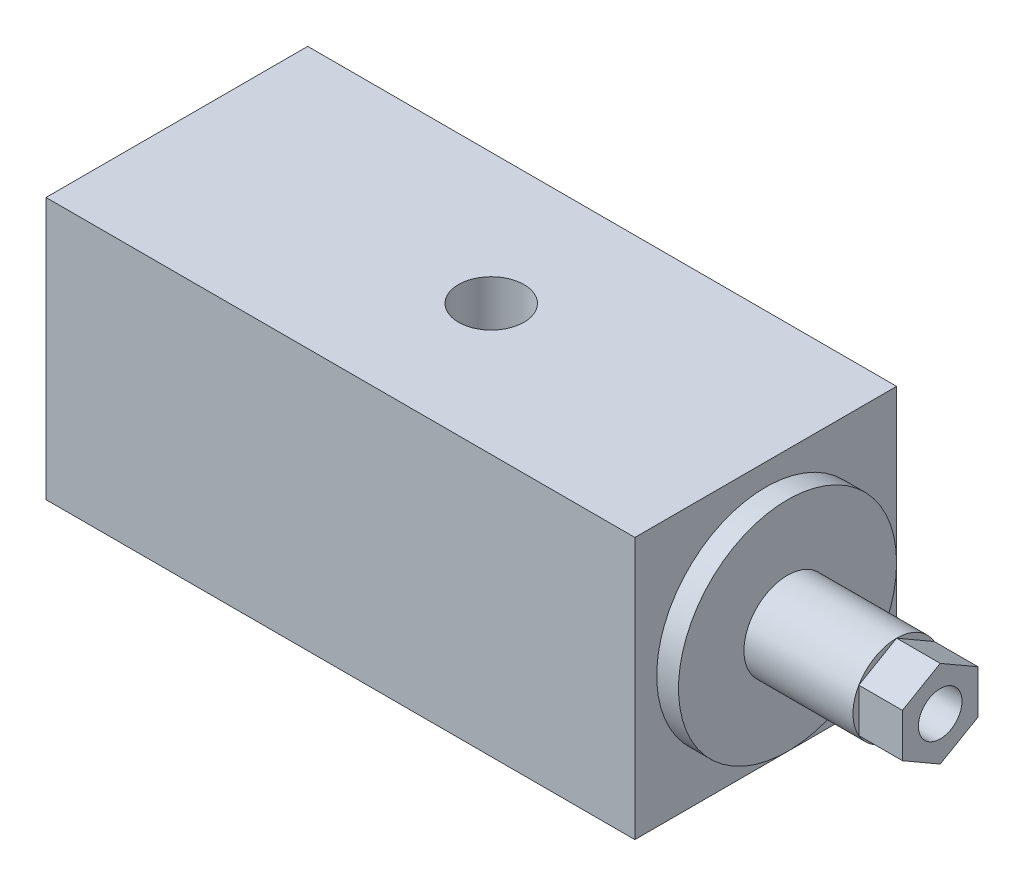
ISO-10303-21;
HEADER;
FILE_DESCRIPTION(('STEP AP214'),'2;1');
FILE_NAME('part.step','',(''),(''),'','','');
FILE_SCHEMA(('AUTOMOTIVE_DESIGN { 1 0 10303 214 1 1 1 1 }'));
ENDSEC;
DATA;
#1=APPLICATION_CONTEXT('core data for automotive mechanical design processes');
#2=APPLICATION_PROTOCOL_DEFINITION('international standard','automotive_design',2000,#1);
#3=PRODUCT_CONTEXT('',#1,'mechanical');
#4=PRODUCT('Part','Part','',(#3));
#5=PRODUCT_RELATED_PRODUCT_CATEGORY('part','',(#4));
#6=PRODUCT_DEFINITION_FORMATION('','',#4);
#7=PRODUCT_DEFINITION_CONTEXT('part definition',#1,'design');
#8=PRODUCT_DEFINITION('design','',#6,#7);
#9=PRODUCT_DEFINITION_SHAPE('','',#8);
#10=(LENGTH_UNIT() NAMED_UNIT(*) SI_UNIT(.MILLI.,.METRE.));
#11=(NAMED_UNIT(*) PLANE_ANGLE_UNIT() SI_UNIT($,.RADIAN.));
#12=(NAMED_UNIT(*) SI_UNIT($,.STERADIAN.) SOLID_ANGLE_UNIT());
#13=UNCERTAINTY_MEASURE_WITH_UNIT(LENGTH_MEASURE(1.E-05),#10,'distance_accuracy_value','');
#14=(GEOMETRIC_REPRESENTATION_CONTEXT(3) GLOBAL_UNCERTAINTY_ASSIGNED_CONTEXT((#13)) GLOBAL_UNIT_ASSIGNED_CONTEXT((#10,
#11,#12)) REPRESENTATION_CONTEXT('',''));
#15=CARTESIAN_POINT('',(0.,0.,0.));
#16=DIRECTION('',(0.,0.,1.));
#17=DIRECTION('',(1.,0.,0.));
#18=AXIS2_PLACEMENT_3D('',#15,#16,#17);
#19=CARTESIAN_POINT('',(1.927606,-9.525,0.));
#20=DIRECTION('',(0.,1.,0.));
#21=DIRECTION('',(0.,0.,1.));
#22=AXIS2_PLACEMENT_3D('',#19,#20,#21);
#23=CYLINDRICAL_SURFACE('',#22,2.38125);
#24=CARTESIAN_POINT('',(1.927606,9.525,0.));
#25=DIRECTION('',(0.,1.,0.));
#26=DIRECTION('',(0.,0.,1.));
#27=AXIS2_PLACEMENT_3D('',#24,#25,#26);
#28=CIRCLE('',#27,2.38125);
#29=CARTESIAN_POINT('',(1.927606,9.525,2.38125));
#30=VERTEX_POINT('',#29);
#31=EDGE_CURVE('E228',#30,#30,#28,.T.);
#32=ORIENTED_EDGE('',*,*,#31,.T.);
#33=EDGE_LOOP('',(#32));
#34=FACE_BOUND('',#33,.T.);
#35=CARTESIAN_POINT('',(1.92760599999999,0.,0.));
#36=DIRECTION('',(-0.707106781186547,0.707106781186548,0.));
#37=DIRECTION('',(0.707106781186547,0.707106781186548,0.));
#38=AXIS2_PLACEMENT_3D('',#35,#36,#37);
#39=ELLIPSE('',#38,3.36759604540093,2.38125);
#40=CARTESIAN_POINT('',(1.92760599999999,0.,-2.38125));
#41=VERTEX_POINT('',#40);
#42=CARTESIAN_POINT('',(1.92760599999999,0.,2.38125));
#43=VERTEX_POINT('',#42);
#44=EDGE_CURVE('E46',#41,#43,#39,.F.);
#45=ORIENTED_EDGE('',*,*,#44,.T.);
#46=CARTESIAN_POINT('',(1.92760599999999,0.,0.));
#47=DIRECTION('',(0.707106781186547,0.707106781186548,0.));
#48=DIRECTION('',(-0.707106781186547,0.707106781186548,0.));
#49=AXIS2_PLACEMENT_3D('',#46,#47,#48);
#50=ELLIPSE('',#49,3.36759604540093,2.38125);
#51=EDGE_CURVE('E11',#43,#41,#50,.F.);
#52=ORIENTED_EDGE('',*,*,#51,.T.);
#53=EDGE_LOOP('',(#45,#52));
#54=FACE_BOUND('',#53,.T.);
#55=ADVANCED_FACE('F33',(#34,#54),#23,.F.);
#56=CARTESIAN_POINT('',(34.6075,0.,0.));
#57=DIRECTION('',(-1.,0.,0.));
#58=DIRECTION('',(0.,0.,1.));
#59=AXIS2_PLACEMENT_3D('',#56,#57,#58);
#60=CYLINDRICAL_SURFACE('',#59,3.175);
#61=CARTESIAN_POINT('',(23.495,0.,0.));
#62=DIRECTION('',(1.,0.,0.));
#63=DIRECTION('',(0.,0.,-1.));
#64=AXIS2_PLACEMENT_3D('',#61,#62,#63);
#65=CIRCLE('',#64,3.175);
#66=CARTESIAN_POINT('',(23.495,0.,-3.175));
#67=VERTEX_POINT('',#66);
#68=EDGE_CURVE('E138',#67,#67,#65,.T.);
#69=ORIENTED_EDGE('',*,*,#68,.T.);
#70=EDGE_LOOP('',(#69));
#71=FACE_BOUND('',#70,.T.);
#72=CARTESIAN_POINT('',(31.4325,0.,0.));
#73=DIRECTION('',(1.,0.,0.));
#74=DIRECTION('',(0.,0.,-1.));
#75=AXIS2_PLACEMENT_3D('',#72,#73,#74);
#76=CIRCLE('',#75,3.175);
#77=CARTESIAN_POINT('',(31.4325,-3.175,0.));
#78=VERTEX_POINT('',#77);
#79=CARTESIAN_POINT('',(31.4325,-1.5875,-2.74963065701559));
#80=VERTEX_POINT('',#79);
#81=EDGE_CURVE('E125',#78,#80,#76,.T.);
#82=ORIENTED_EDGE('',*,*,#81,.F.);
#83=CARTESIAN_POINT('',(31.4325,-1.5875,2.74963065701559));
#84=VERTEX_POINT('',#83);
#85=EDGE_CURVE('E558',#84,#78,#76,.T.);
#86=ORIENTED_EDGE('',*,*,#85,.F.);
#87=CARTESIAN_POINT('',(31.4325,1.5875,2.74963065701559));
#88=VERTEX_POINT('',#87);
#89=EDGE_CURVE('E568',#88,#84,#76,.T.);
#90=ORIENTED_EDGE('',*,*,#89,.F.);
#91=CARTESIAN_POINT('',(31.4325,3.175,0.));
#92=VERTEX_POINT('',#91);
#93=EDGE_CURVE('E563',#92,#88,#76,.T.);
#94=ORIENTED_EDGE('',*,*,#93,.F.);
#95=CARTESIAN_POINT('',(31.4325,1.5875,-2.74963065701559));
#96=VERTEX_POINT('',#95);
#97=EDGE_CURVE('E137',#96,#92,#76,.T.);
#98=ORIENTED_EDGE('',*,*,#97,.F.);
#99=EDGE_CURVE('E135',#80,#96,#76,.T.);
#100=ORIENTED_EDGE('',*,*,#99,.F.);
#101=EDGE_LOOP('',(#82,#86,#90,#94,#98,#100));
#102=FACE_BOUND('',#101,.T.);
#103=ADVANCED_FACE('F252',(#71,#102),#60,.T.);
#104=CARTESIAN_POINT('',(-17.78,9.525,-9.525));
#105=DIRECTION('',(0.,0.,-1.));
#106=DIRECTION('',(0.,1.,0.));
#107=AXIS2_PLACEMENT_3D('',#104,#105,#106);
#108=PLANE('',#107);
#109=DIRECTION('',(1.,0.,0.));
#110=VECTOR('',#109,1.);
#111=CARTESIAN_POINT('',(-17.78,9.525,-9.525));
#112=LINE('',#111,#110);
#113=CARTESIAN_POINT('',(-20.955,9.525,-9.525));
#114=VERTEX_POINT('',#113);
#115=CARTESIAN_POINT('',(21.9075,9.525,-9.525));
#116=VERTEX_POINT('',#115);
#117=EDGE_CURVE('E139',#114,#116,#112,.T.);
#118=ORIENTED_EDGE('',*,*,#117,.T.);
#119=DIRECTION('',(0.,1.,0.));
#120=VECTOR('',#119,1.);
#121=CARTESIAN_POINT('',(21.9075,-9.525,-9.525));
#122=LINE('',#121,#120);
#123=CARTESIAN_POINT('',(21.9075,-9.525,-9.525));
#124=VERTEX_POINT('',#123);
#125=EDGE_CURVE('E157',#124,#116,#122,.T.);
#126=ORIENTED_EDGE('',*,*,#125,.F.);
#127=DIRECTION('',(1.,0.,0.));
#128=VECTOR('',#127,1.);
#129=CARTESIAN_POINT('',(-17.78,-9.525,-9.525));
#130=LINE('',#129,#128);
#131=CARTESIAN_POINT('',(-20.955,-9.525,-9.525));
#132=VERTEX_POINT('',#131);
#133=EDGE_CURVE('E146',#132,#124,#130,.T.);
#134=ORIENTED_EDGE('',*,*,#133,.F.);
#135=DIRECTION('',(0.,-1.,0.));
#136=VECTOR('',#135,1.);
#137=CARTESIAN_POINT('',(-20.955,9.525,-9.525));
#138=LINE('',#137,#136);
#139=EDGE_CURVE('E169',#114,#132,#138,.T.);
#140=ORIENTED_EDGE('',*,*,#139,.F.);
#141=EDGE_LOOP('',(#118,#126,#134,#140));
#142=FACE_BOUND('',#141,.T.);
#143=ADVANCED_FACE('F35',(#142),#108,.T.);
#144=CARTESIAN_POINT('',(-17.78,-9.525,9.525));
#145=DIRECTION('',(0.,-1.,0.));
#146=DIRECTION('',(0.,0.,-1.));
#147=AXIS2_PLACEMENT_3D('',#144,#145,#146);
#148=PLANE('',#147);
#149=CARTESIAN_POINT('',(1.927606,-9.525,0.));
#150=DIRECTION('',(0.,1.,0.));
#151=DIRECTION('',(0.,0.,1.));
#152=AXIS2_PLACEMENT_3D('',#149,#150,#151);
#153=CIRCLE('',#152,2.38125);
#154=CARTESIAN_POINT('',(1.927606,-9.525,2.38125));
#155=VERTEX_POINT('',#154);
#156=EDGE_CURVE('E211',#155,#155,#153,.T.);
#157=ORIENTED_EDGE('',*,*,#156,.T.);
#158=EDGE_LOOP('',(#157));
#159=FACE_BOUND('',#158,.T.);
#160=ORIENTED_EDGE('',*,*,#133,.T.);
#161=DIRECTION('',(0.,0.,-1.));
#162=VECTOR('',#161,1.);
#163=CARTESIAN_POINT('',(21.9075,-9.525,9.525));
#164=LINE('',#163,#162);
#165=CARTESIAN_POINT('',(21.9075,-9.525,9.525));
#166=VERTEX_POINT('',#165);
#167=EDGE_CURVE('E142',#166,#124,#164,.T.);
#168=ORIENTED_EDGE('',*,*,#167,.F.);
#169=DIRECTION('',(1.,0.,0.));
#170=VECTOR('',#169,1.);
#171=CARTESIAN_POINT('',(-17.78,-9.525,9.525));
#172=LINE('',#171,#170);
#173=CARTESIAN_POINT('',(-20.955,-9.525,9.525));
#174=VERTEX_POINT('',#173);
#175=EDGE_CURVE('E144',#174,#166,#172,.T.);
#176=ORIENTED_EDGE('',*,*,#175,.F.);
#177=DIRECTION('',(0.,0.,1.));
#178=VECTOR('',#177,1.);
#179=CARTESIAN_POINT('',(-20.955,-9.525,9.525));
#180=LINE('',#179,#178);
#181=EDGE_CURVE('E166',#132,#174,#180,.T.);
#182=ORIENTED_EDGE('',*,*,#181,.F.);
#183=EDGE_LOOP('',(#160,#168,#176,#182));
#184=FACE_BOUND('',#183,.T.);
#185=ADVANCED_FACE('F298',(#159,#184),#148,.T.);
#186=CARTESIAN_POINT('',(-17.78,9.525,9.525));
#187=DIRECTION('',(0.,0.,1.));
#188=DIRECTION('',(0.,-1.,0.));
#189=AXIS2_PLACEMENT_3D('',#186,#187,#188);
#190=PLANE('',#189);
#191=ORIENTED_EDGE('',*,*,#175,.T.);
#192=DIRECTION('',(0.,-1.,0.));
#193=VECTOR('',#192,1.);
#194=CARTESIAN_POINT('',(21.9075,-9.525,9.525));
#195=LINE('',#194,#193);
#196=CARTESIAN_POINT('',(21.9075,9.525,9.525));
#197=VERTEX_POINT('',#196);
#198=EDGE_CURVE('E151',#197,#166,#195,.T.);
#199=ORIENTED_EDGE('',*,*,#198,.F.);
#200=DIRECTION('',(1.,0.,0.));
#201=VECTOR('',#200,1.);
#202=CARTESIAN_POINT('',(-17.78,9.525,9.525));
#203=LINE('',#202,#201);
#204=CARTESIAN_POINT('',(-20.955,9.525,9.525));
#205=VERTEX_POINT('',#204);
#206=EDGE_CURVE('E141',#205,#197,#203,.T.);
#207=ORIENTED_EDGE('',*,*,#206,.F.);
#208=DIRECTION('',(0.,1.,0.));
#209=VECTOR('',#208,1.);
#210=CARTESIAN_POINT('',(-20.955,9.525,9.525));
#211=LINE('',#210,#209);
#212=EDGE_CURVE('E163',#174,#205,#211,.T.);
#213=ORIENTED_EDGE('',*,*,#212,.F.);
#214=EDGE_LOOP('',(#191,#199,#207,#213));
#215=FACE_BOUND('',#214,.T.);
#216=ADVANCED_FACE('F301',(#215),#190,.T.);
#217=CARTESIAN_POINT('',(-17.78,9.525,9.525));
#218=DIRECTION('',(0.,1.,0.));
#219=DIRECTION('',(0.,0.,1.));
#220=AXIS2_PLACEMENT_3D('',#217,#218,#219);
#221=PLANE('',#220);
#222=ORIENTED_EDGE('',*,*,#31,.F.);
#223=EDGE_LOOP('',(#222));
#224=FACE_BOUND('',#223,.T.);
#225=ORIENTED_EDGE('',*,*,#206,.T.);
#226=DIRECTION('',(0.,0.,1.));
#227=VECTOR('',#226,1.);
#228=CARTESIAN_POINT('',(21.9075,9.525,9.525));
#229=LINE('',#228,#227);
#230=EDGE_CURVE('E154',#116,#197,#229,.T.);
#231=ORIENTED_EDGE('',*,*,#230,.F.);
#232=ORIENTED_EDGE('',*,*,#117,.F.);
#233=DIRECTION('',(0.,0.,-1.));
#234=VECTOR('',#233,1.);
#235=CARTESIAN_POINT('',(-20.955,9.525,9.525));
#236=LINE('',#235,#234);
#237=EDGE_CURVE('E160',#205,#114,#236,.T.);
#238=ORIENTED_EDGE('',*,*,#237,.F.);
#239=EDGE_LOOP('',(#225,#231,#232,#238));
#240=FACE_BOUND('',#239,.T.);
#241=ADVANCED_FACE('F296',(#224,#240),#221,.T.);
#242=CARTESIAN_POINT('',(21.9075,0.,0.));
#243=DIRECTION('',(-1.,0.,0.));
#244=DIRECTION('',(0.,0.,1.));
#245=AXIS2_PLACEMENT_3D('',#242,#243,#244);
#246=PLANE('',#245);
#247=CARTESIAN_POINT('',(21.9075,0.,0.));
#248=DIRECTION('',(1.,0.,0.));
#249=DIRECTION('',(0.,0.,-1.));
#250=AXIS2_PLACEMENT_3D('',#247,#248,#249);
#251=CIRCLE('',#250,7.9375);
#252=CARTESIAN_POINT('',(21.9075,0.,-7.9375));
#253=VERTEX_POINT('',#252);
#254=EDGE_CURVE('E148',#253,#253,#251,.T.);
#255=ORIENTED_EDGE('',*,*,#254,.F.);
#256=EDGE_LOOP('',(#255));
#257=FACE_BOUND('',#256,.T.);
#258=ORIENTED_EDGE('',*,*,#125,.T.);
#259=ORIENTED_EDGE('',*,*,#230,.T.);
#260=ORIENTED_EDGE('',*,*,#198,.T.);
#261=ORIENTED_EDGE('',*,*,#167,.T.);
#262=EDGE_LOOP('',(#258,#259,#260,#261));
#263=FACE_BOUND('',#262,.T.);
#264=ADVANCED_FACE('F293',(#257,#263),#246,.F.);
#265=CARTESIAN_POINT('',(-20.955,0.,0.));
#266=DIRECTION('',(1.,0.,0.));
#267=DIRECTION('',(0.,0.,-1.));
#268=AXIS2_PLACEMENT_3D('',#265,#266,#267);
#269=PLANE('',#268);
#270=CARTESIAN_POINT('',(-20.955,0.,0.));
#271=DIRECTION('',(1.,0.,0.));
#272=DIRECTION('',(0.,0.,-1.));
#273=AXIS2_PLACEMENT_3D('',#270,#271,#272);
#274=CIRCLE('',#273,2.38125);
#275=CARTESIAN_POINT('',(-20.955,0.,-2.38125));
#276=VERTEX_POINT('',#275);
#277=EDGE_CURVE('E134',#276,#276,#274,.T.);
#278=ORIENTED_EDGE('',*,*,#277,.T.);
#279=EDGE_LOOP('',(#278));
#280=FACE_BOUND('',#279,.T.);
#281=ORIENTED_EDGE('',*,*,#139,.T.);
#282=ORIENTED_EDGE('',*,*,#181,.T.);
#283=ORIENTED_EDGE('',*,*,#212,.T.);
#284=ORIENTED_EDGE('',*,*,#237,.T.);
#285=EDGE_LOOP('',(#281,#282,#283,#284));
#286=FACE_BOUND('',#285,.T.);
#287=ADVANCED_FACE('F239',(#280,#286),#269,.F.);
#288=CARTESIAN_POINT('',(23.495,0.,0.));
#289=DIRECTION('',(-1.,0.,0.));
#290=DIRECTION('',(0.,0.,1.));
#291=AXIS2_PLACEMENT_3D('',#288,#289,#290);
#292=CYLINDRICAL_SURFACE('',#291,7.9375);
#293=CARTESIAN_POINT('',(23.495,0.,0.));
#294=DIRECTION('',(1.,0.,0.));
#295=DIRECTION('',(0.,0.,-1.));
#296=AXIS2_PLACEMENT_3D('',#293,#294,#295);
#297=CIRCLE('',#296,7.9375);
#298=CARTESIAN_POINT('',(23.495,0.,-7.9375));
#299=VERTEX_POINT('',#298);
#300=EDGE_CURVE('E172',#299,#299,#297,.T.);
#301=ORIENTED_EDGE('',*,*,#300,.F.);
#302=EDGE_LOOP('',(#301));
#303=FACE_BOUND('',#302,.T.);
#304=ORIENTED_EDGE('',*,*,#254,.T.);
#305=EDGE_LOOP('',(#304));
#306=FACE_BOUND('',#305,.T.);
#307=ADVANCED_FACE('F286',(#303,#306),#292,.T.);
#308=CARTESIAN_POINT('',(23.495,0.,0.));
#309=DIRECTION('',(1.,0.,0.));
#310=DIRECTION('',(0.,0.,-1.));
#311=AXIS2_PLACEMENT_3D('',#308,#309,#310);
#312=PLANE('',#311);
#313=ORIENTED_EDGE('',*,*,#68,.F.);
#314=EDGE_LOOP('',(#313));
#315=FACE_BOUND('',#314,.T.);
#316=ORIENTED_EDGE('',*,*,#300,.T.);
#317=EDGE_LOOP('',(#316));
#318=FACE_BOUND('',#317,.T.);
#319=ADVANCED_FACE('F283',(#315,#318),#312,.T.);
#320=CARTESIAN_POINT('',(31.4325,0.,0.));
#321=DIRECTION('',(1.,0.,0.));
#322=DIRECTION('',(0.,0.,-1.));
#323=AXIS2_PLACEMENT_3D('',#320,#321,#322);
#324=PLANE('',#323);
#325=ORIENTED_EDGE('',*,*,#97,.T.);
#326=DIRECTION('',(0.,0.5,0.866025403784439));
#327=VECTOR('',#326,1.);
#328=CARTESIAN_POINT('',(31.4325,1.5875,-2.74963065701559));
#329=LINE('',#328,#327);
#330=EDGE_CURVE('E217',#96,#92,#329,.T.);
#331=ORIENTED_EDGE('',*,*,#330,.F.);
#332=EDGE_LOOP('',(#325,#331));
#333=FACE_BOUND('',#332,.T.);
#334=ADVANCED_FACE('F280',(#333),#324,.T.);
#335=ORIENTED_EDGE('',*,*,#93,.T.);
#336=DIRECTION('',(0.,-0.5,0.866025403784439));
#337=VECTOR('',#336,1.);
#338=CARTESIAN_POINT('',(31.4325,3.175,0.));
#339=LINE('',#338,#337);
#340=EDGE_CURVE('E214',#92,#88,#339,.T.);
#341=ORIENTED_EDGE('',*,*,#340,.F.);
#342=EDGE_LOOP('',(#335,#341));
#343=FACE_BOUND('',#342,.T.);
#344=ADVANCED_FACE('F372',(#343),#324,.T.);
#345=ORIENTED_EDGE('',*,*,#89,.T.);
#346=DIRECTION('',(0.,-1.,0.));
#347=VECTOR('',#346,1.);
#348=CARTESIAN_POINT('',(31.4325,1.5875,2.74963065701559));
#349=LINE('',#348,#347);
#350=EDGE_CURVE('E183',#88,#84,#349,.T.);
#351=ORIENTED_EDGE('',*,*,#350,.F.);
#352=EDGE_LOOP('',(#345,#351));
#353=FACE_BOUND('',#352,.T.);
#354=ADVANCED_FACE('F382',(#353),#324,.T.);
#355=ORIENTED_EDGE('',*,*,#85,.T.);
#356=DIRECTION('',(0.,-0.5,-0.866025403784438));
#357=VECTOR('',#356,1.);
#358=CARTESIAN_POINT('',(31.4325,-1.5875,2.74963065701559));
#359=LINE('',#358,#357);
#360=EDGE_CURVE('E195',#84,#78,#359,.T.);
#361=ORIENTED_EDGE('',*,*,#360,.F.);
#362=EDGE_LOOP('',(#355,#361));
#363=FACE_BOUND('',#362,.T.);
#364=ADVANCED_FACE('F391',(#363),#324,.T.);
#365=ORIENTED_EDGE('',*,*,#81,.T.);
#366=DIRECTION('',(0.,0.5,-0.866025403784439));
#367=VECTOR('',#366,1.);
#368=CARTESIAN_POINT('',(31.4325,-3.175,0.));
#369=LINE('',#368,#367);
#370=EDGE_CURVE('E54',#78,#80,#369,.T.);
#371=ORIENTED_EDGE('',*,*,#370,.F.);
#372=EDGE_LOOP('',(#365,#371));
#373=FACE_BOUND('',#372,.T.);
#374=ADVANCED_FACE('F400',(#373),#324,.T.);
#375=ORIENTED_EDGE('',*,*,#99,.T.);
#376=DIRECTION('',(0.,1.,0.));
#377=VECTOR('',#376,1.);
#378=CARTESIAN_POINT('',(31.4325,-1.5875,-2.74963065701559));
#379=LINE('',#378,#377);
#380=EDGE_CURVE('E220',#80,#96,#379,.T.);
#381=ORIENTED_EDGE('',*,*,#380,.F.);
#382=EDGE_LOOP('',(#375,#381));
#383=FACE_BOUND('',#382,.T.);
#384=ADVANCED_FACE('F374',(#383),#324,.T.);
#385=CARTESIAN_POINT('',(31.4325,-1.5875,2.74963065701559));
#386=DIRECTION('',(0.,-0.866025403784438,0.5));
#387=DIRECTION('',(0.,-0.5,-0.866025403784439));
#388=AXIS2_PLACEMENT_3D('',#385,#386,#387);
#389=PLANE('',#388);
#390=DIRECTION('',(0.,-0.5,-0.866025403784438));
#391=VECTOR('',#390,1.);
#392=CARTESIAN_POINT('',(34.6075,-1.5875,2.74963065701559));
#393=LINE('',#392,#391);
#394=CARTESIAN_POINT('',(34.6075,-1.5875,2.74963065701559));
#395=VERTEX_POINT('',#394);
#396=CARTESIAN_POINT('',(34.6075,-3.175,0.));
#397=VERTEX_POINT('',#396);
#398=EDGE_CURVE('E208',#395,#397,#393,.T.);
#399=ORIENTED_EDGE('',*,*,#398,.F.);
#400=DIRECTION('',(1.,0.,0.));
#401=VECTOR('',#400,1.);
#402=CARTESIAN_POINT('',(31.4325,-1.5875,2.74963065701559));
#403=LINE('',#402,#401);
#404=EDGE_CURVE('E177',#84,#395,#403,.T.);
#405=ORIENTED_EDGE('',*,*,#404,.F.);
#406=ORIENTED_EDGE('',*,*,#360,.T.);
#407=DIRECTION('',(1.,0.,0.));
#408=VECTOR('',#407,1.);
#409=CARTESIAN_POINT('',(31.4325,-3.175,0.));
#410=LINE('',#409,#408);
#411=EDGE_CURVE('E180',#78,#397,#410,.T.);
#412=ORIENTED_EDGE('',*,*,#411,.T.);
#413=EDGE_LOOP('',(#399,#405,#406,#412));
#414=FACE_BOUND('',#413,.T.);
#415=ADVANCED_FACE('F417',(#414),#389,.T.);
#416=CARTESIAN_POINT('',(31.4325,1.5875,2.74963065701559));
#417=DIRECTION('',(0.,0.,1.));
#418=DIRECTION('',(0.,-1.,0.));
#419=AXIS2_PLACEMENT_3D('',#416,#417,#418);
#420=PLANE('',#419);
#421=DIRECTION('',(0.,-1.,0.));
#422=VECTOR('',#421,1.);
#423=CARTESIAN_POINT('',(34.6075,1.5875,2.74963065701559));
#424=LINE('',#423,#422);
#425=CARTESIAN_POINT('',(34.6075,1.5875,2.74963065701559));
#426=VERTEX_POINT('',#425);
#427=EDGE_CURVE('E192',#426,#395,#424,.T.);
#428=ORIENTED_EDGE('',*,*,#427,.F.);
#429=DIRECTION('',(1.,0.,0.));
#430=VECTOR('',#429,1.);
#431=CARTESIAN_POINT('',(31.4325,1.5875,2.74963065701559));
#432=LINE('',#431,#430);
#433=EDGE_CURVE('E189',#88,#426,#432,.T.);
#434=ORIENTED_EDGE('',*,*,#433,.F.);
#435=ORIENTED_EDGE('',*,*,#350,.T.);
#436=ORIENTED_EDGE('',*,*,#404,.T.);
#437=EDGE_LOOP('',(#428,#434,#435,#436));
#438=FACE_BOUND('',#437,.T.);
#439=ADVANCED_FACE('F426',(#438),#420,.T.);
#440=CARTESIAN_POINT('',(31.4325,3.175,0.));
#441=DIRECTION('',(0.,0.866025403784439,0.5));
#442=DIRECTION('',(0.,-0.5,0.866025403784439));
#443=AXIS2_PLACEMENT_3D('',#440,#441,#442);
#444=PLANE('',#443);
#445=DIRECTION('',(0.,-0.5,0.866025403784439));
#446=VECTOR('',#445,1.);
#447=CARTESIAN_POINT('',(34.6075,3.175,0.));
#448=LINE('',#447,#446);
#449=CARTESIAN_POINT('',(34.6075,3.175,0.));
#450=VERTEX_POINT('',#449);
#451=EDGE_CURVE('E196',#450,#426,#448,.T.);
#452=ORIENTED_EDGE('',*,*,#451,.F.);
#453=DIRECTION('',(1.,0.,0.));
#454=VECTOR('',#453,1.);
#455=CARTESIAN_POINT('',(31.4325,3.175,0.));
#456=LINE('',#455,#454);
#457=EDGE_CURVE('E187',#92,#450,#456,.T.);
#458=ORIENTED_EDGE('',*,*,#457,.F.);
#459=ORIENTED_EDGE('',*,*,#340,.T.);
#460=ORIENTED_EDGE('',*,*,#433,.T.);
#461=EDGE_LOOP('',(#452,#458,#459,#460));
#462=FACE_BOUND('',#461,.T.);
#463=ADVANCED_FACE('F435',(#462),#444,.T.);
#464=CARTESIAN_POINT('',(31.4325,1.5875,-2.74963065701559));
#465=DIRECTION('',(0.,0.866025403784439,-0.5));
#466=DIRECTION('',(0.,0.5,0.866025403784439));
#467=AXIS2_PLACEMENT_3D('',#464,#465,#466);
#468=PLANE('',#467);
#469=DIRECTION('',(0.,0.5,0.866025403784439));
#470=VECTOR('',#469,1.);
#471=CARTESIAN_POINT('',(34.6075,1.5875,-2.74963065701559));
#472=LINE('',#471,#470);
#473=CARTESIAN_POINT('',(34.6075,1.5875,-2.74963065701559));
#474=VERTEX_POINT('',#473);
#475=EDGE_CURVE('E199',#474,#450,#472,.T.);
#476=ORIENTED_EDGE('',*,*,#475,.F.);
#477=DIRECTION('',(1.,0.,0.));
#478=VECTOR('',#477,1.);
#479=CARTESIAN_POINT('',(31.4325,1.5875,-2.74963065701559));
#480=LINE('',#479,#478);
#481=EDGE_CURVE('E185',#96,#474,#480,.T.);
#482=ORIENTED_EDGE('',*,*,#481,.F.);
#483=ORIENTED_EDGE('',*,*,#330,.T.);
#484=ORIENTED_EDGE('',*,*,#457,.T.);
#485=EDGE_LOOP('',(#476,#482,#483,#484));
#486=FACE_BOUND('',#485,.T.);
#487=ADVANCED_FACE('F444',(#486),#468,.T.);
#488=CARTESIAN_POINT('',(31.4325,-1.5875,-2.74963065701559));
#489=DIRECTION('',(0.,0.,-1.));
#490=DIRECTION('',(0.,1.,0.));
#491=AXIS2_PLACEMENT_3D('',#488,#489,#490);
#492=PLANE('',#491);
#493=DIRECTION('',(0.,1.,0.));
#494=VECTOR('',#493,1.);
#495=CARTESIAN_POINT('',(34.6075,-1.5875,-2.74963065701559));
#496=LINE('',#495,#494);
#497=CARTESIAN_POINT('',(34.6075,-1.5875,-2.74963065701559));
#498=VERTEX_POINT('',#497);
#499=EDGE_CURVE('E202',#498,#474,#496,.T.);
#500=ORIENTED_EDGE('',*,*,#499,.F.);
#501=DIRECTION('',(1.,0.,0.));
#502=VECTOR('',#501,1.);
#503=CARTESIAN_POINT('',(31.4325,-1.5875,-2.74963065701559));
#504=LINE('',#503,#502);
#505=EDGE_CURVE('E182',#80,#498,#504,.T.);
#506=ORIENTED_EDGE('',*,*,#505,.F.);
#507=ORIENTED_EDGE('',*,*,#380,.T.);
#508=ORIENTED_EDGE('',*,*,#481,.T.);
#509=EDGE_LOOP('',(#500,#506,#507,#508));
#510=FACE_BOUND('',#509,.T.);
#511=ADVANCED_FACE('F275',(#510),#492,.T.);
#512=CARTESIAN_POINT('',(31.4325,-3.175,0.));
#513=DIRECTION('',(0.,-0.866025403784439,-0.5));
#514=DIRECTION('',(0.,0.5,-0.866025403784439));
#515=AXIS2_PLACEMENT_3D('',#512,#513,#514);
#516=PLANE('',#515);
#517=DIRECTION('',(0.,0.5,-0.866025403784439));
#518=VECTOR('',#517,1.);
#519=CARTESIAN_POINT('',(34.6075,-3.175,0.));
#520=LINE('',#519,#518);
#521=EDGE_CURVE('E205',#397,#498,#520,.T.);
#522=ORIENTED_EDGE('',*,*,#521,.F.);
#523=ORIENTED_EDGE('',*,*,#411,.F.);
#524=ORIENTED_EDGE('',*,*,#370,.T.);
#525=ORIENTED_EDGE('',*,*,#505,.T.);
#526=EDGE_LOOP('',(#522,#523,#524,#525));
#527=FACE_BOUND('',#526,.T.);
#528=ADVANCED_FACE('F269',(#527),#516,.T.);
#529=CARTESIAN_POINT('',(34.6075,0.,0.));
#530=DIRECTION('',(1.,0.,0.));
#531=DIRECTION('',(0.,0.,-1.));
#532=AXIS2_PLACEMENT_3D('',#529,#530,#531);
#533=PLANE('',#532);
#534=CARTESIAN_POINT('',(34.6075,0.,0.));
#535=DIRECTION('',(1.,0.,0.));
#536=DIRECTION('',(0.,0.,-1.));
#537=AXIS2_PLACEMENT_3D('',#534,#535,#536);
#538=CIRCLE('',#537,1.5875);
#539=CARTESIAN_POINT('',(34.6075,0.,-1.5875));
#540=VERTEX_POINT('',#539);
#541=EDGE_CURVE('E133',#540,#540,#538,.T.);
#542=ORIENTED_EDGE('',*,*,#541,.F.);
#543=EDGE_LOOP('',(#542));
#544=FACE_BOUND('',#543,.T.);
#545=ORIENTED_EDGE('',*,*,#427,.T.);
#546=ORIENTED_EDGE('',*,*,#398,.T.);
#547=ORIENTED_EDGE('',*,*,#521,.T.);
#548=ORIENTED_EDGE('',*,*,#499,.T.);
#549=ORIENTED_EDGE('',*,*,#475,.T.);
#550=ORIENTED_EDGE('',*,*,#451,.T.);
#551=EDGE_LOOP('',(#545,#546,#547,#548,#549,#550));
#552=FACE_BOUND('',#551,.T.);
#553=ADVANCED_FACE('F263',(#544,#552),#533,.T.);
#554=CARTESIAN_POINT('',(1.92760599999999,0.,0.));
#555=DIRECTION('',(-0.707106781186547,0.707106781186548,0.));
#556=DIRECTION('',(0.707106781186547,0.707106781186548,0.));
#557=AXIS2_PLACEMENT_3D('',#554,#555,#556);
#558=ELLIPSE('',#557,3.36759604540093,2.38125);
#559=EDGE_CURVE('E118',#41,#43,#558,.T.);
#560=ORIENTED_EDGE('',*,*,#559,.T.);
#561=CARTESIAN_POINT('',(1.92760599999999,0.,0.));
#562=DIRECTION('',(0.707106781186547,0.707106781186548,0.));
#563=DIRECTION('',(-0.707106781186547,0.707106781186548,0.));
#564=AXIS2_PLACEMENT_3D('',#561,#562,#563);
#565=ELLIPSE('',#564,3.36759604540093,2.38125);
#566=EDGE_CURVE('E41',#43,#41,#565,.T.);
#567=ORIENTED_EDGE('',*,*,#566,.T.);
#568=EDGE_LOOP('',(#560,#567));
#569=FACE_BOUND('',#568,.T.);
#570=ORIENTED_EDGE('',*,*,#156,.F.);
#571=EDGE_LOOP('',(#570));
#572=FACE_BOUND('',#571,.T.);
#573=ADVANCED_FACE('F127',(#569,#572),#23,.F.);
#574=CARTESIAN_POINT('',(-20.955,0.,0.));
#575=DIRECTION('',(1.,0.,0.));
#576=DIRECTION('',(0.,0.,-1.));
#577=AXIS2_PLACEMENT_3D('',#574,#575,#576);
#578=CYLINDRICAL_SURFACE('',#577,1.5875);
#579=CARTESIAN_POINT('',(7.62,0.,0.));
#580=DIRECTION('',(1.,0.,0.));
#581=DIRECTION('',(0.,0.,-1.));
#582=AXIS2_PLACEMENT_3D('',#579,#580,#581);
#583=CIRCLE('',#582,1.5875);
#584=CARTESIAN_POINT('',(7.62,0.,-1.5875));
#585=VERTEX_POINT('',#584);
#586=EDGE_CURVE('E130',#585,#585,#583,.F.);
#587=ORIENTED_EDGE('',*,*,#586,.T.);
#588=EDGE_LOOP('',(#587));
#589=FACE_BOUND('',#588,.T.);
#590=ORIENTED_EDGE('',*,*,#541,.T.);
#591=EDGE_LOOP('',(#590));
#592=FACE_BOUND('',#591,.T.);
#593=ADVANCED_FACE('F262',(#589,#592),#578,.F.);
#594=CARTESIAN_POINT('',(7.62,0.,0.));
#595=DIRECTION('',(1.,0.,0.));
#596=DIRECTION('',(0.,0.,-1.));
#597=AXIS2_PLACEMENT_3D('',#594,#595,#596);
#598=PLANE('',#597);
#599=CARTESIAN_POINT('',(7.62,0.,0.));
#600=DIRECTION('',(1.,0.,0.));
#601=DIRECTION('',(0.,0.,-1.));
#602=AXIS2_PLACEMENT_3D('',#599,#600,#601);
#603=CIRCLE('',#602,2.38125);
#604=CARTESIAN_POINT('',(7.62,0.,-2.38125));
#605=VERTEX_POINT('',#604);
#606=EDGE_CURVE('E233',#605,#605,#603,.T.);
#607=ORIENTED_EDGE('',*,*,#606,.F.);
#608=EDGE_LOOP('',(#607));
#609=FACE_BOUND('',#608,.T.);
#610=ORIENTED_EDGE('',*,*,#586,.F.);
#611=EDGE_LOOP('',(#610));
#612=FACE_BOUND('',#611,.T.);
#613=ADVANCED_FACE('F247',(#609,#612),#598,.F.);
#614=CARTESIAN_POINT('',(-20.955,0.,0.));
#615=DIRECTION('',(1.,0.,0.));
#616=DIRECTION('',(0.,0.,-1.));
#617=AXIS2_PLACEMENT_3D('',#614,#615,#616);
#618=CYLINDRICAL_SURFACE('',#617,2.38125);
#619=ORIENTED_EDGE('',*,*,#606,.T.);
#620=EDGE_LOOP('',(#619));
#621=FACE_BOUND('',#620,.T.);
#622=ORIENTED_EDGE('',*,*,#44,.F.);
#623=ORIENTED_EDGE('',*,*,#566,.F.);
#624=EDGE_LOOP('',(#622,#623));
#625=FACE_BOUND('',#624,.T.);
#626=ADVANCED_FACE('F124',(#621,#625),#618,.F.);
#627=ORIENTED_EDGE('',*,*,#277,.F.);
#628=EDGE_LOOP('',(#627));
#629=FACE_BOUND('',#628,.T.);
#630=ORIENTED_EDGE('',*,*,#559,.F.);
#631=ORIENTED_EDGE('',*,*,#51,.F.);
#632=EDGE_LOOP('',(#630,#631));
#633=FACE_BOUND('',#632,.T.);
#634=ADVANCED_FACE('F119',(#629,#633),#618,.F.);
#635=CLOSED_SHELL('',(#55,#103,#143,#185,#216,#241,#264,#287,#307,#319,#334,#344,#354,#364,#374,
#384,#415,#439,#463,#487,#511,#528,#553,#573,#593,#613,#626,#634));
#636=MANIFOLD_SOLID_BREP('B2',#635);
#637=ADVANCED_BREP_SHAPE_REPRESENTATION('',(#18,#636),#14);
#638=SHAPE_DEFINITION_REPRESENTATION(#9,#637);
ENDSEC;
END-ISO-10303-21;
